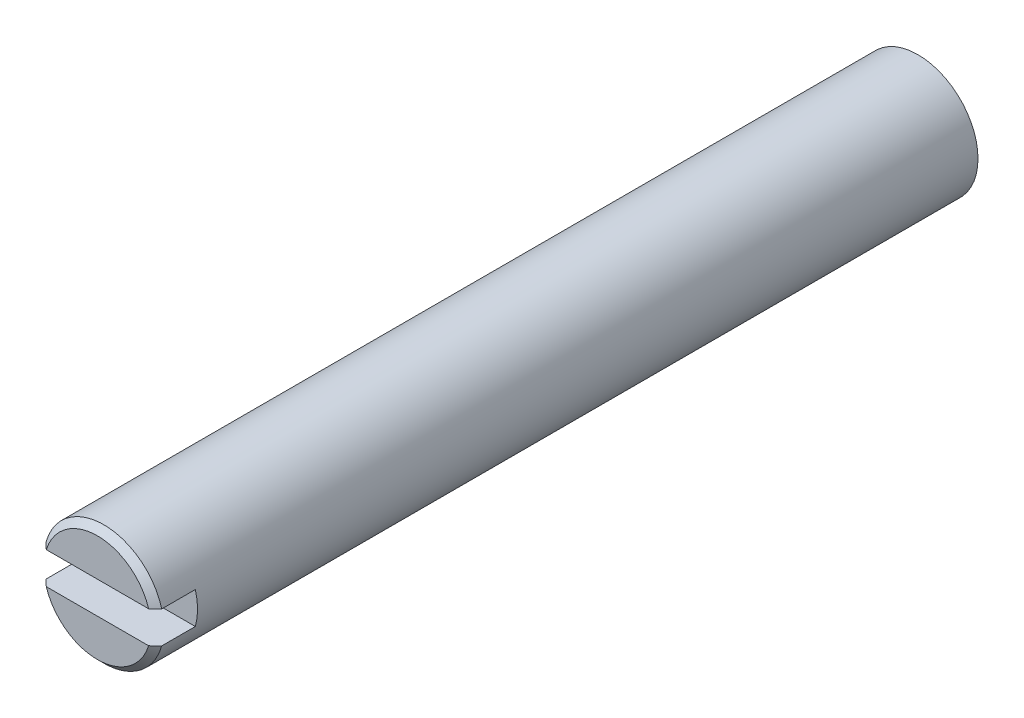
ISO-10303-21;
HEADER;
FILE_DESCRIPTION(('STEP AP214'),'2;1');
FILE_NAME('part.step','',(''),(''),'','','');
FILE_SCHEMA(('AUTOMOTIVE_DESIGN { 1 0 10303 214 1 1 1 1 }'));
ENDSEC;
DATA;
#1=APPLICATION_CONTEXT('core data for automotive mechanical design processes');
#2=APPLICATION_PROTOCOL_DEFINITION('international standard','automotive_design',2000,#1);
#3=PRODUCT_CONTEXT('',#1,'mechanical');
#4=PRODUCT('Part','Part','',(#3));
#5=PRODUCT_RELATED_PRODUCT_CATEGORY('part','',(#4));
#6=PRODUCT_DEFINITION_FORMATION('','',#4);
#7=PRODUCT_DEFINITION_CONTEXT('part definition',#1,'design');
#8=PRODUCT_DEFINITION('design','',#6,#7);
#9=PRODUCT_DEFINITION_SHAPE('','',#8);
#10=(LENGTH_UNIT() NAMED_UNIT(*) SI_UNIT(.MILLI.,.METRE.));
#11=(NAMED_UNIT(*) PLANE_ANGLE_UNIT() SI_UNIT($,.RADIAN.));
#12=(NAMED_UNIT(*) SI_UNIT($,.STERADIAN.) SOLID_ANGLE_UNIT());
#13=UNCERTAINTY_MEASURE_WITH_UNIT(LENGTH_MEASURE(1.E-05),#10,'distance_accuracy_value','');
#14=(GEOMETRIC_REPRESENTATION_CONTEXT(3) GLOBAL_UNCERTAINTY_ASSIGNED_CONTEXT((#13)) GLOBAL_UNIT_ASSIGNED_CONTEXT((#10,
#11,#12)) REPRESENTATION_CONTEXT('',''));
#15=CARTESIAN_POINT('',(0.,0.,0.));
#16=DIRECTION('',(0.,0.,1.));
#17=DIRECTION('',(1.,0.,0.));
#18=AXIS2_PLACEMENT_3D('',#15,#16,#17);
#19=CARTESIAN_POINT('',(0.,0.,65.1002));
#20=DIRECTION('',(0.,0.,1.));
#21=DIRECTION('',(1.,0.,0.));
#22=AXIS2_PLACEMENT_3D('',#19,#20,#21);
#23=PLANE('',#22);
#24=DIRECTION('',(1.,0.,0.));
#25=VECTOR('',#24,1.);
#26=CARTESIAN_POINT('',(-6.35,-1.27,65.1002));
#27=LINE('',#26,#25);
#28=CARTESIAN_POINT('',(-4.06052585880202,-1.27,65.1002));
#29=VERTEX_POINT('',#28);
#30=CARTESIAN_POINT('',(4.06052585880202,-1.27,65.1002));
#31=VERTEX_POINT('',#30);
#32=EDGE_CURVE('E111',#29,#31,#27,.T.);
#33=ORIENTED_EDGE('',*,*,#32,.F.);
#34=CARTESIAN_POINT('',(0.,0.,65.1002));
#35=DIRECTION('',(0.,0.,1.));
#36=DIRECTION('',(1.,0.,0.));
#37=AXIS2_PLACEMENT_3D('',#34,#35,#36);
#38=CIRCLE('',#37,4.25449999999999);
#39=EDGE_CURVE('E115',#29,#31,#38,.T.);
#40=ORIENTED_EDGE('',*,*,#39,.T.);
#41=EDGE_LOOP('',(#33,#40));
#42=FACE_BOUND('',#41,.T.);
#43=ADVANCED_FACE('F39',(#42),#23,.T.);
#44=CARTESIAN_POINT('',(0.,0.,65.1002));
#45=DIRECTION('',(0.,0.,-1.));
#46=DIRECTION('',(-1.,0.,0.));
#47=AXIS2_PLACEMENT_3D('',#44,#45,#46);
#48=CONICAL_SURFACE('',#47,4.25449999999999,0.785398163397453);
#49=CARTESIAN_POINT('',(-10.4086294872763,-1.27,58.8688777717054));
#50=CARTESIAN_POINT('',(-10.0954907332174,-1.27,59.1796998507581));
#51=CARTESIAN_POINT('',(-9.78225982674482,-1.27,59.4904292638569));
#52=CARTESIAN_POINT('',(-9.15544642597855,-1.27,60.1116863121733));
#53=CARTESIAN_POINT('',(-8.84186386452951,-1.27,60.4222138796284));
#54=CARTESIAN_POINT('',(-8.21279105413349,-1.27,61.0444237413187));
#55=CARTESIAN_POINT('',(-7.8972990020665,-1.27,61.3561042129775));
#56=CARTESIAN_POINT('',(-7.26586853179891,-1.27,61.9788608498481));
#57=CARTESIAN_POINT('',(-6.94993023932494,-1.27,62.2899371424647));
#58=CARTESIAN_POINT('',(-6.42568179322712,-1.27,62.8048321342564));
#59=CARTESIAN_POINT('',(-6.21759167207239,-1.27,63.0088748069914));
#60=CARTESIAN_POINT('',(-5.80095731357434,-1.27,63.416506318062));
#61=CARTESIAN_POINT('',(-5.5924130653088,-1.27,63.6200951452385));
#62=CARTESIAN_POINT('',(-5.17453854232241,-1.27,64.0268075369639));
#63=CARTESIAN_POINT('',(-4.96520776419529,-1.27,64.2299305847402));
#64=CARTESIAN_POINT('',(-4.54568534387397,-1.27,64.6352483840514));
#65=CARTESIAN_POINT('',(-4.33549378083645,-1.27,64.837443217471));
#66=CARTESIAN_POINT('',(-3.91461392775604,-1.27,65.239698820162));
#67=CARTESIAN_POINT('',(-3.70393063245067,-1.27,65.4397647994169));
#68=CARTESIAN_POINT('',(-3.38631448281528,-1.27,65.7382461576851));
#69=CARTESIAN_POINT('',(-3.28015843439838,-1.27,65.8374876419774));
#70=CARTESIAN_POINT('',(-3.06716595736694,-1.27,66.0352372206246));
#71=CARTESIAN_POINT('',(-2.96032953399364,-1.27,66.1337453206165));
#72=CARTESIAN_POINT('',(-2.74591653978602,-1.27,66.3296284022072));
#73=CARTESIAN_POINT('',(-2.63834132558392,-1.27,66.4270048665956));
#74=CARTESIAN_POINT('',(-2.42196816993728,-1.27,66.6203873455465));
#75=CARTESIAN_POINT('',(-2.31317027124184,-1.27,66.716393407758));
#76=CARTESIAN_POINT('',(-2.09390761497817,-1.27,66.9063637408007));
#77=CARTESIAN_POINT('',(-1.98344380802925,-1.27,67.0003291065891));
#78=CARTESIAN_POINT('',(-1.7600186273072,-1.27,67.1852328099709));
#79=CARTESIAN_POINT('',(-1.64705782022486,-1.27,67.2761718228878));
#80=CARTESIAN_POINT('',(-1.49431625235804,-1.27,67.3937534441392));
#81=CARTESIAN_POINT('',(-1.45625129824797,-1.27,67.4226238990674));
#82=CARTESIAN_POINT('',(-1.37962489403241,-1.27,67.4797045533928));
#83=CARTESIAN_POINT('',(-1.34106341376726,-1.27,67.5079147123865));
#84=CARTESIAN_POINT('',(-1.26333610217841,-1.27,67.5635604894113));
#85=CARTESIAN_POINT('',(-1.2241698054909,-1.27,67.5909954598302));
#86=CARTESIAN_POINT('',(-1.14516751836546,-1.27,67.6448819257298));
#87=CARTESIAN_POINT('',(-1.1053315388579,-1.27,67.6713334372397));
#88=CARTESIAN_POINT('',(-0.985555442644061,-1.27,67.7483140483527));
#89=CARTESIAN_POINT('',(-0.904479364919433,-1.27,67.7971027189824));
#90=CARTESIAN_POINT('',(-0.7383339201487,-1.27,67.8873286072415));
#91=CARTESIAN_POINT('',(-0.653271256816718,-1.27,67.9287776430408));
#92=CARTESIAN_POINT('',(-0.52568309997846,-1.27,67.9806873400897));
#93=CARTESIAN_POINT('',(-0.485049712101709,-1.27,67.995778989366));
#94=CARTESIAN_POINT('',(-0.402771278985452,-1.27,68.0229285139146));
#95=CARTESIAN_POINT('',(-0.361126348451499,-1.27,68.0349867314231));
#96=CARTESIAN_POINT('',(-0.277195542001701,-1.27,68.0554335540509));
#97=CARTESIAN_POINT('',(-0.234914996249684,-1.27,68.0638436972195));
#98=CARTESIAN_POINT('',(-0.149747388393669,-1.27,68.0765944212912));
#99=CARTESIAN_POINT('',(-0.106860534911498,-1.27,68.0809363689955));
#100=CARTESIAN_POINT('',(-0.0204562125713222,-1.27,68.0852748037793));
#101=CARTESIAN_POINT('',(0.0230633865271738,-1.27,68.0852298589144));
#102=CARTESIAN_POINT('',(0.109866988074031,-1.27,68.080694077829));
#103=CARTESIAN_POINT('',(0.153150979035482,-1.27,68.0762030267596));
#104=CARTESIAN_POINT('',(0.239284695070926,-1.27,68.0630596820387));
#105=CARTESIAN_POINT('',(0.282131316615217,-1.27,68.0543874124405));
#106=CARTESIAN_POINT('',(0.366912822599832,-1.27,68.0333989062889));
#107=CARTESIAN_POINT('',(0.408847529233206,-1.27,68.0210819658093));
#108=CARTESIAN_POINT('',(0.52926988975152,-1.27,67.9808467546417));
#109=CARTESIAN_POINT('',(0.606410918585946,-1.27,67.9489110404467));
#110=CARTESIAN_POINT('',(0.757180545201429,-1.27,67.8776116429203));
#111=CARTESIAN_POINT('',(0.830802822978391,-1.27,67.8382351803443));
#112=CARTESIAN_POINT('',(0.975695705988728,-1.27,67.7542694323198));
#113=CARTESIAN_POINT('',(1.04694516233868,-1.27,67.709644112708));
#114=CARTESIAN_POINT('',(1.15208931788414,-1.27,67.6401956874327));
#115=CARTESIAN_POINT('',(1.18683598220988,-1.27,67.6166373604026));
#116=CARTESIAN_POINT('',(1.25583568279577,-1.27,67.5688096231041));
#117=CARTESIAN_POINT('',(1.29008873655619,-1.27,67.5445402381382));
#118=CARTESIAN_POINT('',(1.39838228729581,-1.27,67.4663883905594));
#119=CARTESIAN_POINT('',(1.47161995696842,-1.27,67.4113943146899));
#120=CARTESIAN_POINT('',(1.61657779599133,-1.27,67.2994352705338));
#121=CARTESIAN_POINT('',(1.68829772324041,-1.27,67.2424699915751));
#122=CARTESIAN_POINT('',(1.83060786935608,-1.27,67.1270801758513));
#123=CARTESIAN_POINT('',(1.90119752875683,-1.27,67.0686549509686));
#124=CARTESIAN_POINT('',(2.0414736859163,-1.27,66.9507283851773));
#125=CARTESIAN_POINT('',(2.11116014979256,-1.27,66.8912270040973));
#126=CARTESIAN_POINT('',(2.3194025243898,-1.27,66.7112934715198));
#127=CARTESIAN_POINT('',(2.45689645886835,-1.27,66.5896337227977));
#128=CARTESIAN_POINT('',(2.73001770270382,-1.27,66.3443287620335));
#129=CARTESIAN_POINT('',(2.86564553721136,-1.27,66.2206841307078));
#130=CARTESIAN_POINT('',(3.13523962142563,-1.27,65.972411497855));
#131=CARTESIAN_POINT('',(3.2692096551813,-1.27,65.8477876000495));
#132=CARTESIAN_POINT('',(3.53626873455734,-1.27,65.5975821057519));
#133=CARTESIAN_POINT('',(3.66935771602316,-1.27,65.4720004409214));
#134=CARTESIAN_POINT('',(4.06738128991668,-1.27,65.0944954878336));
#135=CARTESIAN_POINT('',(4.33134991064821,-1.27,64.8415544900341));
#136=CARTESIAN_POINT('',(4.83932874243041,-1.27,64.3519162752782));
#137=CARTESIAN_POINT('',(5.08344037066153,-1.27,64.1153239132379));
#138=CARTESIAN_POINT('',(5.57080072251279,-1.27,63.6412475355934));
#139=CARTESIAN_POINT('',(5.81404943769986,-1.27,63.4037635113217));
#140=CARTESIAN_POINT('',(6.54312001566166,-1.27,62.6902244986684));
#141=CARTESIAN_POINT('',(7.02806672070719,-1.27,62.2132760026409));
#142=CARTESIAN_POINT('',(7.99613382954075,-1.27,61.2587291504136));
#143=CARTESIAN_POINT('',(8.47925575165799,-1.27,60.7811323315461));
#144=CARTESIAN_POINT('',(9.20327166431485,-1.27,60.0642759829598));
#145=CARTESIAN_POINT('',(9.44444612562239,-1.27,59.8252996680642));
#146=CARTESIAN_POINT('',(9.92664299181945,-1.27,59.3471943948175));
#147=CARTESIAN_POINT('',(10.167665396936,-1.27,59.1080654366955));
#148=CARTESIAN_POINT('',(10.4086294872763,-1.27,58.8688777717054));
#149=B_SPLINE_CURVE_WITH_KNOTS('',3,(#49,#50,#51,#52,#53,#54,#55,#56,#57,#58,#59,#60,#61,#62,
#63,#64,#65,#66,#67,#68,#69,#70,#71,#72,#73,#74,#75,#76,#77,#78,#79,#80,#81,#82,#83,#84,#85,#86,
#87,#88,#89,#90,#91,#92,#93,#94,#95,#96,#97,#98,#99,#100,#101,#102,#103,#104,#105,#106,#107,
#108,#109,#110,#111,#112,#113,#114,#115,#116,#117,#118,#119,#120,#121,#122,#123,#124,#125,#126,
#127,#128,#129,#130,#131,#132,#133,#134,#135,#136,#137,#138,#139,#140,#141,#142,#143,#144,#145,
#146,#147,#148),.UNSPECIFIED.,.F.,.F.,(4,2,2,2,2,2,2,2,2,2,2,2,2,2,2,2,2,2,2,2,2,2,2,2,2,2,2,2,
2,2,2,2,2,2,2,2,2,2,2,2,2,2,2,2,2,2,2,2,2,4),(0.,1.32363010109954,2.64758327714021,
3.97804129228682,5.30817904882399,6.18248637389255,7.05681496446843,7.93185871374924,
8.80682372531254,9.67843388718188,10.1143922391169,10.5503472367339,10.9856458251835,
11.4209292412173,11.8559730234353,12.2909190666531,12.4342381794075,12.5775660390124,
12.7210102956654,12.8644522133309,13.1481173602684,13.4313215161933,13.5612636698123,
13.6911911565891,13.8203407565692,13.9494469502772,14.0797726024929,14.2101045527347,
14.3410654339438,14.472051625265,14.7218509221282,14.9720832060476,15.2241464446903,
15.3500810988163,15.4760112770628,15.7507169638,16.0254661445863,16.3003473612078,
16.5752388600452,17.1259736906156,17.6765502278629,18.2254620339838,18.77441337937,
19.8711801466282,20.891029943357,21.9108896795563,23.9514429685366,25.9894680321742,
27.0080322455563,28.0265949344001),.UNSPECIFIED.);
#150=CARTESIAN_POINT('',(-4.5900442535993,-1.27,64.5922));
#151=VERTEX_POINT('',#150);
#152=EDGE_CURVE('E169',#151,#29,#149,.T.);
#153=ORIENTED_EDGE('',*,*,#152,.F.);
#154=CARTESIAN_POINT('',(0.,0.,64.5922));
#155=DIRECTION('',(0.,0.,1.));
#156=DIRECTION('',(1.,0.,0.));
#157=AXIS2_PLACEMENT_3D('',#154,#155,#156);
#158=CIRCLE('',#157,4.7625);
#159=CARTESIAN_POINT('',(4.5900442535993,-1.27,64.5922));
#160=VERTEX_POINT('',#159);
#161=EDGE_CURVE('E119',#160,#151,#158,.F.);
#162=ORIENTED_EDGE('',*,*,#161,.F.);
#163=EDGE_CURVE('E103',#31,#160,#149,.T.);
#164=ORIENTED_EDGE('',*,*,#163,.F.);
#165=ORIENTED_EDGE('',*,*,#39,.F.);
#166=EDGE_LOOP('',(#153,#162,#164,#165));
#167=FACE_BOUND('',#166,.T.);
#168=ADVANCED_FACE('F151',(#167),#48,.T.);
#169=CARTESIAN_POINT('',(0.,0.,65.1002));
#170=DIRECTION('',(0.,0.,-1.));
#171=DIRECTION('',(-1.,0.,0.));
#172=AXIS2_PLACEMENT_3D('',#169,#170,#171);
#173=CYLINDRICAL_SURFACE('',#172,4.7625);
#174=CARTESIAN_POINT('',(0.,0.,61.9252));
#175=DIRECTION('',(0.,0.,-1.));
#176=DIRECTION('',(-1.,0.,0.));
#177=AXIS2_PLACEMENT_3D('',#174,#175,#176);
#178=CIRCLE('',#177,4.7625);
#179=CARTESIAN_POINT('',(4.5900442535993,1.27,61.9252));
#180=VERTEX_POINT('',#179);
#181=CARTESIAN_POINT('',(4.5900442535993,-1.27,61.9252));
#182=VERTEX_POINT('',#181);
#183=EDGE_CURVE('E11',#180,#182,#178,.T.);
#184=ORIENTED_EDGE('',*,*,#183,.T.);
#185=DIRECTION('',(0.,0.,-1.));
#186=VECTOR('',#185,1.);
#187=CARTESIAN_POINT('',(4.5900442535993,-1.27,65.1002));
#188=LINE('',#187,#186);
#189=EDGE_CURVE('E182',#182,#160,#188,.F.);
#190=ORIENTED_EDGE('',*,*,#189,.T.);
#191=ORIENTED_EDGE('',*,*,#161,.T.);
#192=DIRECTION('',(0.,0.,-1.));
#193=VECTOR('',#192,1.);
#194=CARTESIAN_POINT('',(-4.5900442535993,-1.27,65.1002));
#195=LINE('',#194,#193);
#196=CARTESIAN_POINT('',(-4.5900442535993,-1.27,61.9252));
#197=VERTEX_POINT('',#196);
#198=EDGE_CURVE('E64',#151,#197,#195,.T.);
#199=ORIENTED_EDGE('',*,*,#198,.T.);
#200=CARTESIAN_POINT('',(-4.5900442535993,1.27,61.9252));
#201=VERTEX_POINT('',#200);
#202=EDGE_CURVE('E44',#197,#201,#178,.T.);
#203=ORIENTED_EDGE('',*,*,#202,.T.);
#204=DIRECTION('',(0.,0.,-1.));
#205=VECTOR('',#204,1.);
#206=CARTESIAN_POINT('',(-4.5900442535993,1.27,65.1002));
#207=LINE('',#206,#205);
#208=CARTESIAN_POINT('',(-4.5900442535993,1.27,64.5922));
#209=VERTEX_POINT('',#208);
#210=EDGE_CURVE('E176',#201,#209,#207,.F.);
#211=ORIENTED_EDGE('',*,*,#210,.T.);
#212=CARTESIAN_POINT('',(4.5900442535993,1.27,64.5922));
#213=VERTEX_POINT('',#212);
#214=EDGE_CURVE('E114',#209,#213,#158,.F.);
#215=ORIENTED_EDGE('',*,*,#214,.T.);
#216=DIRECTION('',(0.,0.,-1.));
#217=VECTOR('',#216,1.);
#218=CARTESIAN_POINT('',(4.5900442535993,1.27,65.1002));
#219=LINE('',#218,#217);
#220=EDGE_CURVE('E97',#213,#180,#219,.T.);
#221=ORIENTED_EDGE('',*,*,#220,.T.);
#222=EDGE_LOOP('',(#184,#190,#191,#199,#203,#211,#215,#221));
#223=FACE_BOUND('',#222,.T.);
#224=CARTESIAN_POINT('',(0.,0.,0.));
#225=DIRECTION('',(0.,0.,1.));
#226=DIRECTION('',(1.,0.,0.));
#227=AXIS2_PLACEMENT_3D('',#224,#225,#226);
#228=CIRCLE('',#227,4.7625);
#229=CARTESIAN_POINT('',(4.7625,0.,0.));
#230=VERTEX_POINT('',#229);
#231=EDGE_CURVE('E122',#230,#230,#228,.T.);
#232=ORIENTED_EDGE('',*,*,#231,.T.);
#233=EDGE_LOOP('',(#232));
#234=FACE_BOUND('',#233,.T.);
#235=ADVANCED_FACE('F147',(#223,#234),#173,.T.);
#236=DIRECTION('',(-1.,0.,0.));
#237=VECTOR('',#236,1.);
#238=CARTESIAN_POINT('',(-6.35,1.27,65.1002));
#239=LINE('',#238,#237);
#240=CARTESIAN_POINT('',(4.06052585880202,1.27,65.1002));
#241=VERTEX_POINT('',#240);
#242=CARTESIAN_POINT('',(-4.06052585880202,1.27,65.1002));
#243=VERTEX_POINT('',#242);
#244=EDGE_CURVE('E56',#241,#243,#239,.T.);
#245=ORIENTED_EDGE('',*,*,#244,.F.);
#246=EDGE_CURVE('E109',#241,#243,#38,.T.);
#247=ORIENTED_EDGE('',*,*,#246,.T.);
#248=EDGE_LOOP('',(#245,#247));
#249=FACE_BOUND('',#248,.T.);
#250=ADVANCED_FACE('F108',(#249),#23,.T.);
#251=CARTESIAN_POINT('',(0.,0.,0.));
#252=DIRECTION('',(0.,0.,1.));
#253=DIRECTION('',(1.,0.,0.));
#254=AXIS2_PLACEMENT_3D('',#251,#252,#253);
#255=PLANE('',#254);
#256=ORIENTED_EDGE('',*,*,#231,.F.);
#257=EDGE_LOOP('',(#256));
#258=FACE_BOUND('',#257,.T.);
#259=ADVANCED_FACE('F146',(#258),#255,.F.);
#260=CARTESIAN_POINT('',(10.4086294872763,1.27,58.8688777717054));
#261=CARTESIAN_POINT('',(10.0954907332174,1.27,59.1796998507581));
#262=CARTESIAN_POINT('',(9.78225982674482,1.27,59.4904292638569));
#263=CARTESIAN_POINT('',(9.15544642597855,1.27,60.1116863121733));
#264=CARTESIAN_POINT('',(8.84186386452951,1.27,60.4222138796284));
#265=CARTESIAN_POINT('',(8.21279105413348,1.27,61.0444237413187));
#266=CARTESIAN_POINT('',(7.8972990020665,1.27,61.3561042129775));
#267=CARTESIAN_POINT('',(7.2658685317989,1.27,61.9788608498481));
#268=CARTESIAN_POINT('',(6.94993023932493,1.27,62.2899371424647));
#269=CARTESIAN_POINT('',(6.42568179322711,1.27,62.8048321342564));
#270=CARTESIAN_POINT('',(6.21759167207238,1.27,63.0088748069914));
#271=CARTESIAN_POINT('',(5.80095731357434,1.27,63.416506318062));
#272=CARTESIAN_POINT('',(5.59241306530879,1.27,63.6200951452385));
#273=CARTESIAN_POINT('',(5.17453854232241,1.27,64.0268075369639));
#274=CARTESIAN_POINT('',(4.9652077641953,1.27,64.2299305847402));
#275=CARTESIAN_POINT('',(4.54568534387397,1.27,64.6352483840514));
#276=CARTESIAN_POINT('',(4.33549378083645,1.27,64.837443217471));
#277=CARTESIAN_POINT('',(3.91461392775605,1.27,65.239698820162));
#278=CARTESIAN_POINT('',(3.70393063245067,1.27,65.4397647994169));
#279=CARTESIAN_POINT('',(3.38631448281529,1.27,65.7382461576851));
#280=CARTESIAN_POINT('',(3.28015843439838,1.27,65.8374876419774));
#281=CARTESIAN_POINT('',(3.06716595736694,1.27,66.0352372206246));
#282=CARTESIAN_POINT('',(2.96032953399364,1.27,66.1337453206165));
#283=CARTESIAN_POINT('',(2.74591653978602,1.27,66.3296284022072));
#284=CARTESIAN_POINT('',(2.63834132558392,1.27,66.4270048665956));
#285=CARTESIAN_POINT('',(2.42196816993728,1.27,66.6203873455465));
#286=CARTESIAN_POINT('',(2.31317027124184,1.27,66.716393407758));
#287=CARTESIAN_POINT('',(2.09390761497817,1.27,66.9063637408007));
#288=CARTESIAN_POINT('',(1.98344380802925,1.27,67.0003291065891));
#289=CARTESIAN_POINT('',(1.7600186273072,1.27,67.1852328099709));
#290=CARTESIAN_POINT('',(1.64705782022486,1.27,67.2761718228878));
#291=CARTESIAN_POINT('',(1.49431625235804,1.27,67.3937534441392));
#292=CARTESIAN_POINT('',(1.45625129824797,1.27,67.4226238990674));
#293=CARTESIAN_POINT('',(1.37962489403241,1.27,67.4797045533928));
#294=CARTESIAN_POINT('',(1.34106341376726,1.27,67.5079147123865));
#295=CARTESIAN_POINT('',(1.26333610217841,1.27,67.5635604894113));
#296=CARTESIAN_POINT('',(1.2241698054909,1.27,67.5909954598302));
#297=CARTESIAN_POINT('',(1.14516751836546,1.27,67.6448819257298));
#298=CARTESIAN_POINT('',(1.1053315388579,1.27,67.6713334372397));
#299=CARTESIAN_POINT('',(0.985555442644065,1.27,67.7483140483527));
#300=CARTESIAN_POINT('',(0.904479364919441,1.27,67.7971027189824));
#301=CARTESIAN_POINT('',(0.738333920148708,1.27,67.8873286072415));
#302=CARTESIAN_POINT('',(0.653271256816721,1.27,67.9287776430408));
#303=CARTESIAN_POINT('',(0.525683099978459,1.27,67.9806873400897));
#304=CARTESIAN_POINT('',(0.485049712101708,1.27,67.995778989366));
#305=CARTESIAN_POINT('',(0.402771278985452,1.27,68.0229285139146));
#306=CARTESIAN_POINT('',(0.3611263484515,1.27,68.0349867314231));
#307=CARTESIAN_POINT('',(0.277195542001702,1.27,68.0554335540509));
#308=CARTESIAN_POINT('',(0.234914996249684,1.27,68.0638436972195));
#309=CARTESIAN_POINT('',(0.149747388393669,1.27,68.0765944212912));
#310=CARTESIAN_POINT('',(0.106860534911498,1.27,68.0809363689955));
#311=CARTESIAN_POINT('',(0.0204562125713228,1.27,68.0852748037793));
#312=CARTESIAN_POINT('',(-0.0230633865271727,1.27,68.0852298589144));
#313=CARTESIAN_POINT('',(-0.10986698807403,1.27,68.080694077829));
#314=CARTESIAN_POINT('',(-0.15315097903548,1.27,68.0762030267596));
#315=CARTESIAN_POINT('',(-0.239284695070925,1.27,68.0630596820387));
#316=CARTESIAN_POINT('',(-0.282131316615217,1.27,68.0543874124405));
#317=CARTESIAN_POINT('',(-0.366912822599832,1.27,68.0333989062889));
#318=CARTESIAN_POINT('',(-0.408847529233206,1.27,68.0210819658093));
#319=CARTESIAN_POINT('',(-0.52926988975152,1.27,67.9808467546417));
#320=CARTESIAN_POINT('',(-0.606410918585945,1.27,67.9489110404467));
#321=CARTESIAN_POINT('',(-0.757180545201428,1.27,67.8776116429203));
#322=CARTESIAN_POINT('',(-0.830802822978389,1.27,67.8382351803443));
#323=CARTESIAN_POINT('',(-0.975695705988728,1.27,67.7542694323198));
#324=CARTESIAN_POINT('',(-1.04694516233868,1.27,67.709644112708));
#325=CARTESIAN_POINT('',(-1.15208931788414,1.27,67.6401956874327));
#326=CARTESIAN_POINT('',(-1.18683598220989,1.27,67.6166373604026));
#327=CARTESIAN_POINT('',(-1.25583568279577,1.27,67.5688096231041));
#328=CARTESIAN_POINT('',(-1.29008873655619,1.27,67.5445402381382));
#329=CARTESIAN_POINT('',(-1.39838228729581,1.27,67.4663883905594));
#330=CARTESIAN_POINT('',(-1.47161995696843,1.27,67.4113943146899));
#331=CARTESIAN_POINT('',(-1.61657779599133,1.27,67.2994352705338));
#332=CARTESIAN_POINT('',(-1.68829772324041,1.27,67.2424699915751));
#333=CARTESIAN_POINT('',(-1.83060786935608,1.27,67.1270801758513));
#334=CARTESIAN_POINT('',(-1.90119752875684,1.27,67.0686549509686));
#335=CARTESIAN_POINT('',(-2.04147368591631,1.27,66.9507283851773));
#336=CARTESIAN_POINT('',(-2.11116014979257,1.27,66.8912270040973));
#337=CARTESIAN_POINT('',(-2.31940252438981,1.27,66.7112934715197));
#338=CARTESIAN_POINT('',(-2.45689645886835,1.27,66.5896337227977));
#339=CARTESIAN_POINT('',(-2.73001770270383,1.27,66.3443287620335));
#340=CARTESIAN_POINT('',(-2.86564553721136,1.27,66.2206841307078));
#341=CARTESIAN_POINT('',(-3.13523962142563,1.27,65.972411497855));
#342=CARTESIAN_POINT('',(-3.2692096551813,1.27,65.8477876000495));
#343=CARTESIAN_POINT('',(-3.53626873455734,1.27,65.5975821057519));
#344=CARTESIAN_POINT('',(-3.66935771602316,1.27,65.4720004409214));
#345=CARTESIAN_POINT('',(-4.06738128991668,1.27,65.0944954878336));
#346=CARTESIAN_POINT('',(-4.33134991064821,1.27,64.8415544900341));
#347=CARTESIAN_POINT('',(-4.83932874243041,1.27,64.3519162752782));
#348=CARTESIAN_POINT('',(-5.08344037066153,1.27,64.1153239132379));
#349=CARTESIAN_POINT('',(-5.57080072251279,1.27,63.6412475355934));
#350=CARTESIAN_POINT('',(-5.81404943769986,1.27,63.4037635113217));
#351=CARTESIAN_POINT('',(-6.54312001566166,1.27,62.6902244986684));
#352=CARTESIAN_POINT('',(-7.02806672070719,1.27,62.2132760026409));
#353=CARTESIAN_POINT('',(-7.99613382954075,1.27,61.2587291504136));
#354=CARTESIAN_POINT('',(-8.47925575165799,1.27,60.7811323315461));
#355=CARTESIAN_POINT('',(-9.20327166431485,1.27,60.0642759829598));
#356=CARTESIAN_POINT('',(-9.44444612562239,1.27,59.8252996680642));
#357=CARTESIAN_POINT('',(-9.92664299181944,1.27,59.3471943948175));
#358=CARTESIAN_POINT('',(-10.167665396936,1.27,59.1080654366955));
#359=CARTESIAN_POINT('',(-10.4086294872763,1.27,58.8688777717054));
#360=B_SPLINE_CURVE_WITH_KNOTS('',3,(#260,#261,#262,#263,#264,#265,#266,#267,#268,#269,#270,
#271,#272,#273,#274,#275,#276,#277,#278,#279,#280,#281,#282,#283,#284,#285,#286,#287,#288,#289,
#290,#291,#292,#293,#294,#295,#296,#297,#298,#299,#300,#301,#302,#303,#304,#305,#306,#307,#308,
#309,#310,#311,#312,#313,#314,#315,#316,#317,#318,#319,#320,#321,#322,#323,#324,#325,#326,#327,
#328,#329,#330,#331,#332,#333,#334,#335,#336,#337,#338,#339,#340,#341,#342,#343,#344,#345,#346,
#347,#348,#349,#350,#351,#352,#353,#354,#355,#356,#357,#358,#359),.UNSPECIFIED.,.F.,.F.,(4,2,2,
2,2,2,2,2,2,2,2,2,2,2,2,2,2,2,2,2,2,2,2,2,2,2,2,2,2,2,2,2,2,2,2,2,2,2,2,2,2,2,2,2,2,2,2,2,2,4),
(0.,1.32363010109955,2.64758327714021,3.97804129228683,5.30817904882399,6.18248637389255,
7.05681496446843,7.93185871374922,8.80682372531254,9.67843388718188,10.1143922391169,
10.5503472367339,10.9856458251835,11.4209292412173,11.8559730234353,12.2909190666531,
12.4342381794075,12.5775660390124,12.7210102956654,12.8644522133309,13.1481173602684,
13.4313215161933,13.5612636698123,13.6911911565891,13.8203407565692,13.9494469502772,
14.0797726024929,14.2101045527347,14.3410654339438,14.472051625265,14.7218509221282,
14.9720832060476,15.2241464446903,15.3500810988163,15.4760112770628,15.7507169638,
16.0254661445863,16.3003473612078,16.5752388600452,17.1259736906156,17.6765502278629,
18.2254620339838,18.77441337937,19.8711801466282,20.891029943357,21.9108896795563,
23.9514429685366,25.9894680321742,27.0080322455563,28.0265949344001),.UNSPECIFIED.);
#361=EDGE_CURVE('E93',#213,#241,#360,.T.);
#362=ORIENTED_EDGE('',*,*,#361,.F.);
#363=ORIENTED_EDGE('',*,*,#214,.F.);
#364=EDGE_CURVE('E104',#243,#209,#360,.T.);
#365=ORIENTED_EDGE('',*,*,#364,.F.);
#366=ORIENTED_EDGE('',*,*,#246,.F.);
#367=EDGE_LOOP('',(#362,#363,#365,#366));
#368=FACE_BOUND('',#367,.T.);
#369=ADVANCED_FACE('F41',(#368),#48,.T.);
#370=CARTESIAN_POINT('',(0.,0.,61.9252));
#371=DIRECTION('',(0.,0.,-1.));
#372=DIRECTION('',(-1.,0.,0.));
#373=AXIS2_PLACEMENT_3D('',#370,#371,#372);
#374=PLANE('',#373);
#375=DIRECTION('',(-1.,0.,0.));
#376=VECTOR('',#375,1.);
#377=CARTESIAN_POINT('',(-6.35,1.27,61.9252));
#378=LINE('',#377,#376);
#379=EDGE_CURVE('E166',#180,#201,#378,.T.);
#380=ORIENTED_EDGE('',*,*,#379,.T.);
#381=ORIENTED_EDGE('',*,*,#202,.F.);
#382=DIRECTION('',(1.,0.,0.));
#383=VECTOR('',#382,1.);
#384=CARTESIAN_POINT('',(-6.35,-1.27,61.9252));
#385=LINE('',#384,#383);
#386=EDGE_CURVE('E181',#197,#182,#385,.T.);
#387=ORIENTED_EDGE('',*,*,#386,.T.);
#388=ORIENTED_EDGE('',*,*,#183,.F.);
#389=EDGE_LOOP('',(#380,#381,#387,#388));
#390=FACE_BOUND('',#389,.T.);
#391=ADVANCED_FACE('F180',(#390),#374,.F.);
#392=CARTESIAN_POINT('',(-6.35,-1.27,61.9252));
#393=DIRECTION('',(0.,-1.,0.));
#394=DIRECTION('',(0.,0.,-1.));
#395=AXIS2_PLACEMENT_3D('',#392,#393,#394);
#396=PLANE('',#395);
#397=ORIENTED_EDGE('',*,*,#152,.T.);
#398=ORIENTED_EDGE('',*,*,#32,.T.);
#399=ORIENTED_EDGE('',*,*,#163,.T.);
#400=ORIENTED_EDGE('',*,*,#189,.F.);
#401=ORIENTED_EDGE('',*,*,#386,.F.);
#402=ORIENTED_EDGE('',*,*,#198,.F.);
#403=EDGE_LOOP('',(#397,#398,#399,#400,#401,#402));
#404=FACE_BOUND('',#403,.T.);
#405=ADVANCED_FACE('F141',(#404),#396,.F.);
#406=CARTESIAN_POINT('',(-6.35,1.27,61.9252));
#407=DIRECTION('',(0.,1.,0.));
#408=DIRECTION('',(0.,0.,1.));
#409=AXIS2_PLACEMENT_3D('',#406,#407,#408);
#410=PLANE('',#409);
#411=ORIENTED_EDGE('',*,*,#361,.T.);
#412=ORIENTED_EDGE('',*,*,#244,.T.);
#413=ORIENTED_EDGE('',*,*,#364,.T.);
#414=ORIENTED_EDGE('',*,*,#210,.F.);
#415=ORIENTED_EDGE('',*,*,#379,.F.);
#416=ORIENTED_EDGE('',*,*,#220,.F.);
#417=EDGE_LOOP('',(#411,#412,#413,#414,#415,#416));
#418=FACE_BOUND('',#417,.T.);
#419=ADVANCED_FACE('F94',(#418),#410,.F.);
#420=CLOSED_SHELL('',(#43,#168,#235,#250,#259,#369,#391,#405,#419));
#421=MANIFOLD_SOLID_BREP('B2',#420);
#422=ADVANCED_BREP_SHAPE_REPRESENTATION('',(#18,#421),#14);
#423=SHAPE_DEFINITION_REPRESENTATION(#9,#422);
ENDSEC;
END-ISO-10303-21;
